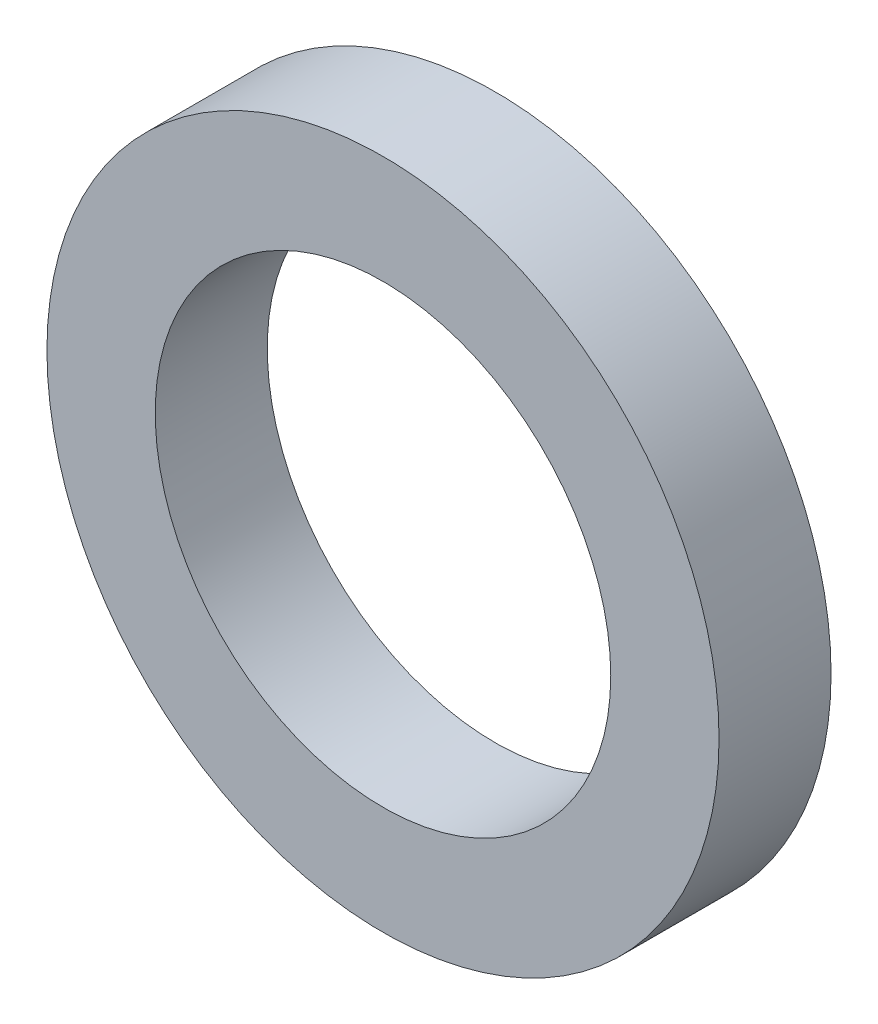
ISO-10303-21;
HEADER;
FILE_DESCRIPTION(('STEP AP214'),'2;1');
FILE_NAME('part.step','',(''),(''),'','','');
FILE_SCHEMA(('AUTOMOTIVE_DESIGN { 1 0 10303 214 1 1 1 1 }'));
ENDSEC;
DATA;
#1=APPLICATION_CONTEXT('core data for automotive mechanical design processes');
#2=APPLICATION_PROTOCOL_DEFINITION('international standard','automotive_design',2000,#1);
#3=PRODUCT_CONTEXT('',#1,'mechanical');
#4=PRODUCT('Part','Part','',(#3));
#5=PRODUCT_RELATED_PRODUCT_CATEGORY('part','',(#4));
#6=PRODUCT_DEFINITION_FORMATION('','',#4);
#7=PRODUCT_DEFINITION_CONTEXT('part definition',#1,'design');
#8=PRODUCT_DEFINITION('design','',#6,#7);
#9=PRODUCT_DEFINITION_SHAPE('','',#8);
#10=(LENGTH_UNIT() NAMED_UNIT(*) SI_UNIT(.MILLI.,.METRE.));
#11=(NAMED_UNIT(*) PLANE_ANGLE_UNIT() SI_UNIT($,.RADIAN.));
#12=(NAMED_UNIT(*) SI_UNIT($,.STERADIAN.) SOLID_ANGLE_UNIT());
#13=UNCERTAINTY_MEASURE_WITH_UNIT(LENGTH_MEASURE(1.E-05),#10,'distance_accuracy_value','');
#14=(GEOMETRIC_REPRESENTATION_CONTEXT(3) GLOBAL_UNCERTAINTY_ASSIGNED_CONTEXT((#13)) GLOBAL_UNIT_ASSIGNED_CONTEXT((#10,
#11,#12)) REPRESENTATION_CONTEXT('',''));
#15=CARTESIAN_POINT('',(0.,0.,0.));
#16=DIRECTION('',(0.,0.,1.));
#17=DIRECTION('',(1.,0.,0.));
#18=AXIS2_PLACEMENT_3D('',#15,#16,#17);
#19=CARTESIAN_POINT('',(0.,0.,1.5));
#20=DIRECTION('',(0.,0.,-1.));
#21=DIRECTION('',(-1.,0.,0.));
#22=AXIS2_PLACEMENT_3D('',#19,#20,#21);
#23=CYLINDRICAL_SURFACE('',#22,4.5);
#24=CARTESIAN_POINT('',(0.,0.,1.5));
#25=DIRECTION('',(0.,0.,1.));
#26=DIRECTION('',(1.,0.,0.));
#27=AXIS2_PLACEMENT_3D('',#24,#25,#26);
#28=CIRCLE('',#27,4.5);
#29=CARTESIAN_POINT('',(4.5,0.,1.5));
#30=VERTEX_POINT('',#29);
#31=EDGE_CURVE('E10',#30,#30,#28,.T.);
#32=ORIENTED_EDGE('',*,*,#31,.F.);
#33=EDGE_LOOP('',(#32));
#34=FACE_BOUND('',#33,.T.);
#35=CARTESIAN_POINT('',(0.,0.,0.));
#36=DIRECTION('',(0.,0.,1.));
#37=DIRECTION('',(1.,0.,0.));
#38=AXIS2_PLACEMENT_3D('',#35,#36,#37);
#39=CIRCLE('',#38,4.5);
#40=CARTESIAN_POINT('',(4.5,0.,0.));
#41=VERTEX_POINT('',#40);
#42=EDGE_CURVE('E38',#41,#41,#39,.T.);
#43=ORIENTED_EDGE('',*,*,#42,.T.);
#44=EDGE_LOOP('',(#43));
#45=FACE_BOUND('',#44,.T.);
#46=ADVANCED_FACE('F35',(#34,#45),#23,.T.);
#47=CARTESIAN_POINT('',(0.,0.,1.5));
#48=DIRECTION('',(0.,0.,1.));
#49=DIRECTION('',(1.,0.,0.));
#50=AXIS2_PLACEMENT_3D('',#47,#48,#49);
#51=PLANE('',#50);
#52=CARTESIAN_POINT('',(0.,0.,1.5));
#53=DIRECTION('',(0.,0.,1.));
#54=DIRECTION('',(1.,0.,0.));
#55=AXIS2_PLACEMENT_3D('',#52,#53,#54);
#56=CIRCLE('',#55,3.05);
#57=CARTESIAN_POINT('',(3.05,0.,1.5));
#58=VERTEX_POINT('',#57);
#59=EDGE_CURVE('E47',#58,#58,#56,.T.);
#60=ORIENTED_EDGE('',*,*,#59,.F.);
#61=EDGE_LOOP('',(#60));
#62=FACE_BOUND('',#61,.T.);
#63=ORIENTED_EDGE('',*,*,#31,.T.);
#64=EDGE_LOOP('',(#63));
#65=FACE_BOUND('',#64,.T.);
#66=ADVANCED_FACE('F62',(#62,#65),#51,.T.);
#67=CARTESIAN_POINT('',(0.,0.,0.));
#68=DIRECTION('',(0.,0.,1.));
#69=DIRECTION('',(1.,0.,0.));
#70=AXIS2_PLACEMENT_3D('',#67,#68,#69);
#71=PLANE('',#70);
#72=CARTESIAN_POINT('',(0.,0.,0.));
#73=DIRECTION('',(0.,0.,1.));
#74=DIRECTION('',(1.,0.,0.));
#75=AXIS2_PLACEMENT_3D('',#72,#73,#74);
#76=CIRCLE('',#75,3.05);
#77=CARTESIAN_POINT('',(3.05,0.,0.));
#78=VERTEX_POINT('',#77);
#79=EDGE_CURVE('E45',#78,#78,#76,.T.);
#80=ORIENTED_EDGE('',*,*,#79,.T.);
#81=EDGE_LOOP('',(#80));
#82=FACE_BOUND('',#81,.T.);
#83=ORIENTED_EDGE('',*,*,#42,.F.);
#84=EDGE_LOOP('',(#83));
#85=FACE_BOUND('',#84,.T.);
#86=ADVANCED_FACE('F53',(#82,#85),#71,.F.);
#87=CARTESIAN_POINT('',(0.,0.,0.));
#88=DIRECTION('',(0.,0.,1.));
#89=DIRECTION('',(1.,0.,0.));
#90=AXIS2_PLACEMENT_3D('',#87,#88,#89);
#91=CYLINDRICAL_SURFACE('',#90,3.05);
#92=ORIENTED_EDGE('',*,*,#79,.F.);
#93=EDGE_LOOP('',(#92));
#94=FACE_BOUND('',#93,.T.);
#95=ORIENTED_EDGE('',*,*,#59,.T.);
#96=EDGE_LOOP('',(#95));
#97=FACE_BOUND('',#96,.T.);
#98=ADVANCED_FACE('F56',(#94,#97),#91,.F.);
#99=CLOSED_SHELL('',(#46,#66,#86,#98));
#100=MANIFOLD_SOLID_BREP('B2',#99);
#101=ADVANCED_BREP_SHAPE_REPRESENTATION('',(#18,#100),#14);
#102=SHAPE_DEFINITION_REPRESENTATION(#9,#101);
ENDSEC;
END-ISO-10303-21;
